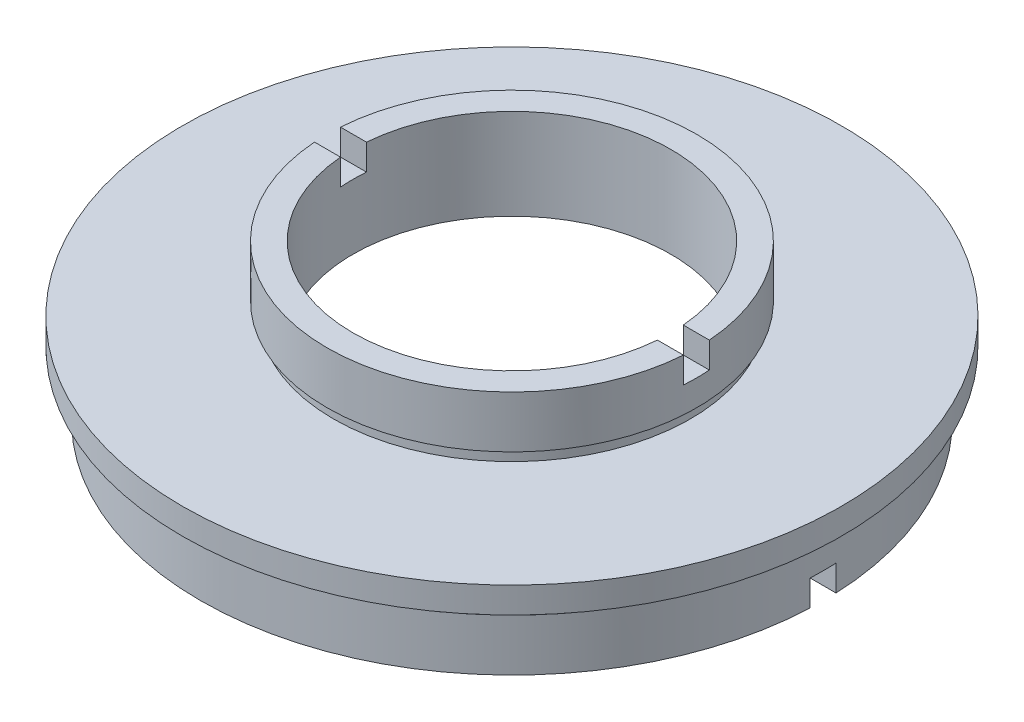
ISO-10303-21;
HEADER;
FILE_DESCRIPTION(('STEP AP214'),'2;1');
FILE_NAME('part.step','',(''),(''),'','','');
FILE_SCHEMA(('AUTOMOTIVE_DESIGN { 1 0 10303 214 1 1 1 1 }'));
ENDSEC;
DATA;
#1=APPLICATION_CONTEXT('core data for automotive mechanical design processes');
#2=APPLICATION_PROTOCOL_DEFINITION('international standard','automotive_design',2000,#1);
#3=PRODUCT_CONTEXT('',#1,'mechanical');
#4=PRODUCT('Part','Part','',(#3));
#5=PRODUCT_RELATED_PRODUCT_CATEGORY('part','',(#4));
#6=PRODUCT_DEFINITION_FORMATION('','',#4);
#7=PRODUCT_DEFINITION_CONTEXT('part definition',#1,'design');
#8=PRODUCT_DEFINITION('design','',#6,#7);
#9=PRODUCT_DEFINITION_SHAPE('','',#8);
#10=(LENGTH_UNIT() NAMED_UNIT(*) SI_UNIT(.MILLI.,.METRE.));
#11=(NAMED_UNIT(*) PLANE_ANGLE_UNIT() SI_UNIT($,.RADIAN.));
#12=(NAMED_UNIT(*) SI_UNIT($,.STERADIAN.) SOLID_ANGLE_UNIT());
#13=UNCERTAINTY_MEASURE_WITH_UNIT(LENGTH_MEASURE(1.E-05),#10,'distance_accuracy_value','');
#14=(GEOMETRIC_REPRESENTATION_CONTEXT(3) GLOBAL_UNCERTAINTY_ASSIGNED_CONTEXT((#13)) GLOBAL_UNIT_ASSIGNED_CONTEXT((#10,
#11,#12)) REPRESENTATION_CONTEXT('',''));
#15=CARTESIAN_POINT('',(0.,0.,0.));
#16=DIRECTION('',(0.,0.,1.));
#17=DIRECTION('',(1.,0.,0.));
#18=AXIS2_PLACEMENT_3D('',#15,#16,#17);
#19=CARTESIAN_POINT('',(-24.,0.,0.));
#20=DIRECTION('',(0.,-1.,0.));
#21=DIRECTION('',(0.,0.,-1.));
#22=AXIS2_PLACEMENT_3D('',#19,#20,#21);
#23=PLANE('',#22);
#24=DIRECTION('',(-1.,0.,0.));
#25=VECTOR('',#24,1.);
#26=CARTESIAN_POINT('',(-24.,0.,1.));
#27=LINE('',#26,#25);
#28=CARTESIAN_POINT('',(23.9791576165636,0.,1.));
#29=VERTEX_POINT('',#28);
#30=CARTESIAN_POINT('',(20.4755952294433,0.,1.));
#31=VERTEX_POINT('',#30);
#32=EDGE_CURVE('E184',#29,#31,#27,.T.);
#33=ORIENTED_EDGE('',*,*,#32,.F.);
#34=CARTESIAN_POINT('',(0.,0.,0.));
#35=DIRECTION('',(0.,1.,0.));
#36=DIRECTION('',(0.,0.,1.));
#37=AXIS2_PLACEMENT_3D('',#34,#35,#36);
#38=CIRCLE('',#37,24.);
#39=CARTESIAN_POINT('',(-23.9791576165636,0.,1.));
#40=VERTEX_POINT('',#39);
#41=EDGE_CURVE('E239',#40,#29,#38,.T.);
#42=ORIENTED_EDGE('',*,*,#41,.F.);
#43=CARTESIAN_POINT('',(-20.4755952294433,0.,1.));
#44=VERTEX_POINT('',#43);
#45=EDGE_CURVE('E162',#44,#40,#27,.T.);
#46=ORIENTED_EDGE('',*,*,#45,.F.);
#47=CARTESIAN_POINT('',(0.,0.,0.));
#48=DIRECTION('',(0.,1.,0.));
#49=DIRECTION('',(0.,0.,1.));
#50=AXIS2_PLACEMENT_3D('',#47,#48,#49);
#51=CIRCLE('',#50,20.5);
#52=EDGE_CURVE('E235',#44,#31,#51,.T.);
#53=ORIENTED_EDGE('',*,*,#52,.T.);
#54=EDGE_LOOP('',(#33,#42,#46,#53));
#55=FACE_BOUND('',#54,.T.);
#56=ADVANCED_FACE('F39',(#55),#23,.T.);
#57=CARTESIAN_POINT('',(-12.25,12.,0.));
#58=DIRECTION('',(0.,1.,0.));
#59=DIRECTION('',(0.,0.,1.));
#60=AXIS2_PLACEMENT_3D('',#57,#58,#59);
#61=PLANE('',#60);
#62=DIRECTION('',(1.,0.,0.));
#63=VECTOR('',#62,1.);
#64=CARTESIAN_POINT('',(-12.25,12.,1.));
#65=LINE('',#64,#63);
#66=CARTESIAN_POINT('',(-14.2148689758295,12.,1.));
#67=VERTEX_POINT('',#66);
#68=CARTESIAN_POINT('',(-12.2091154470748,12.,1.));
#69=VERTEX_POINT('',#68);
#70=EDGE_CURVE('E271',#67,#69,#65,.T.);
#71=ORIENTED_EDGE('',*,*,#70,.F.);
#72=CARTESIAN_POINT('',(0.,12.,0.));
#73=DIRECTION('',(0.,1.,0.));
#74=DIRECTION('',(0.,0.,1.));
#75=AXIS2_PLACEMENT_3D('',#72,#73,#74);
#76=CIRCLE('',#75,14.25);
#77=CARTESIAN_POINT('',(14.2148689758295,12.,1.));
#78=VERTEX_POINT('',#77);
#79=EDGE_CURVE('E215',#67,#78,#76,.T.);
#80=ORIENTED_EDGE('',*,*,#79,.T.);
#81=CARTESIAN_POINT('',(12.2091154470748,12.,1.));
#82=VERTEX_POINT('',#81);
#83=EDGE_CURVE('E269',#82,#78,#65,.T.);
#84=ORIENTED_EDGE('',*,*,#83,.F.);
#85=CARTESIAN_POINT('',(0.,12.,0.));
#86=DIRECTION('',(0.,1.,0.));
#87=DIRECTION('',(0.,0.,1.));
#88=AXIS2_PLACEMENT_3D('',#85,#86,#87);
#89=CIRCLE('',#88,12.25);
#90=EDGE_CURVE('E219',#69,#82,#89,.T.);
#91=ORIENTED_EDGE('',*,*,#90,.F.);
#92=EDGE_LOOP('',(#71,#80,#84,#91));
#93=FACE_BOUND('',#92,.T.);
#94=ADVANCED_FACE('F320',(#93),#61,.T.);
#95=CARTESIAN_POINT('',(0.,22.6774994510759,0.));
#96=DIRECTION('',(0.,1.,0.));
#97=DIRECTION('',(0.,0.,1.));
#98=AXIS2_PLACEMENT_3D('',#95,#96,#97);
#99=CYLINDRICAL_SURFACE('',#98,14.25);
#100=DIRECTION('',(0.,1.,0.));
#101=VECTOR('',#100,1.);
#102=CARTESIAN_POINT('',(-14.2148689758295,22.6774994510759,1.));
#103=LINE('',#102,#101);
#104=CARTESIAN_POINT('',(-14.2148689758295,10.,1.));
#105=VERTEX_POINT('',#104);
#106=EDGE_CURVE('E210',#105,#67,#103,.T.);
#107=ORIENTED_EDGE('',*,*,#106,.F.);
#108=CARTESIAN_POINT('',(0.,10.,0.));
#109=DIRECTION('',(0.,-1.,0.));
#110=DIRECTION('',(0.,0.,-1.));
#111=AXIS2_PLACEMENT_3D('',#108,#109,#110);
#112=CIRCLE('',#111,14.25);
#113=CARTESIAN_POINT('',(-14.2148689758295,10.,-0.999999999999997));
#114=VERTEX_POINT('',#113);
#115=EDGE_CURVE('E214',#114,#105,#112,.F.);
#116=ORIENTED_EDGE('',*,*,#115,.F.);
#117=DIRECTION('',(0.,1.,0.));
#118=VECTOR('',#117,1.);
#119=CARTESIAN_POINT('',(-14.2148689758295,22.6774994510759,-1.));
#120=LINE('',#119,#118);
#121=CARTESIAN_POINT('',(-14.2148689758295,12.,-0.999999999999998));
#122=VERTEX_POINT('',#121);
#123=EDGE_CURVE('E198',#122,#114,#120,.F.);
#124=ORIENTED_EDGE('',*,*,#123,.F.);
#125=CARTESIAN_POINT('',(14.2148689758295,12.,-0.999999999999998));
#126=VERTEX_POINT('',#125);
#127=EDGE_CURVE('E218',#126,#122,#76,.T.);
#128=ORIENTED_EDGE('',*,*,#127,.F.);
#129=DIRECTION('',(0.,1.,0.));
#130=VECTOR('',#129,1.);
#131=CARTESIAN_POINT('',(14.2148689758295,22.6774994510759,-1.));
#132=LINE('',#131,#130);
#133=CARTESIAN_POINT('',(14.2148689758295,10.,-0.999999999999997));
#134=VERTEX_POINT('',#133);
#135=EDGE_CURVE('E202',#134,#126,#132,.T.);
#136=ORIENTED_EDGE('',*,*,#135,.F.);
#137=CARTESIAN_POINT('',(14.2148689758295,10.,1.));
#138=VERTEX_POINT('',#137);
#139=EDGE_CURVE('E212',#138,#134,#112,.F.);
#140=ORIENTED_EDGE('',*,*,#139,.F.);
#141=DIRECTION('',(0.,1.,0.));
#142=VECTOR('',#141,1.);
#143=CARTESIAN_POINT('',(14.2148689758295,22.6774994510759,1.));
#144=LINE('',#143,#142);
#145=EDGE_CURVE('E206',#78,#138,#144,.F.);
#146=ORIENTED_EDGE('',*,*,#145,.F.);
#147=ORIENTED_EDGE('',*,*,#79,.F.);
#148=EDGE_LOOP('',(#107,#116,#124,#128,#136,#140,#146,#147));
#149=FACE_BOUND('',#148,.T.);
#150=CARTESIAN_POINT('',(0.,8.,0.));
#151=DIRECTION('',(0.,1.,0.));
#152=DIRECTION('',(0.,0.,1.));
#153=AXIS2_PLACEMENT_3D('',#150,#151,#152);
#154=CIRCLE('',#153,14.25);
#155=CARTESIAN_POINT('',(0.,8.,14.25));
#156=VERTEX_POINT('',#155);
#157=EDGE_CURVE('E263',#156,#156,#154,.T.);
#158=ORIENTED_EDGE('',*,*,#157,.T.);
#159=EDGE_LOOP('',(#158));
#160=FACE_BOUND('',#159,.T.);
#161=ADVANCED_FACE('F41',(#149,#160),#99,.T.);
#162=CARTESIAN_POINT('',(-14.25,8.,0.));
#163=DIRECTION('',(0.,-1.,0.));
#164=DIRECTION('',(0.,0.,-1.));
#165=AXIS2_PLACEMENT_3D('',#162,#163,#164);
#166=PLANE('',#165);
#167=CARTESIAN_POINT('',(0.,8.,0.));
#168=DIRECTION('',(0.,1.,0.));
#169=DIRECTION('',(0.,0.,1.));
#170=AXIS2_PLACEMENT_3D('',#167,#168,#169);
#171=CIRCLE('',#170,13.75);
#172=CARTESIAN_POINT('',(0.,8.,13.75));
#173=VERTEX_POINT('',#172);
#174=EDGE_CURVE('E260',#173,#173,#171,.T.);
#175=ORIENTED_EDGE('',*,*,#174,.T.);
#176=EDGE_LOOP('',(#175));
#177=FACE_BOUND('',#176,.T.);
#178=ORIENTED_EDGE('',*,*,#157,.F.);
#179=EDGE_LOOP('',(#178));
#180=FACE_BOUND('',#179,.T.);
#181=ADVANCED_FACE('F330',(#177,#180),#166,.T.);
#182=CARTESIAN_POINT('',(0.,22.6774994510759,0.));
#183=DIRECTION('',(0.,1.,0.));
#184=DIRECTION('',(0.,0.,1.));
#185=AXIS2_PLACEMENT_3D('',#182,#183,#184);
#186=CYLINDRICAL_SURFACE('',#185,13.75);
#187=CARTESIAN_POINT('',(0.,7.,0.));
#188=DIRECTION('',(0.,1.,0.));
#189=DIRECTION('',(0.,0.,1.));
#190=AXIS2_PLACEMENT_3D('',#187,#188,#189);
#191=CIRCLE('',#190,13.75);
#192=CARTESIAN_POINT('',(0.,7.,13.75));
#193=VERTEX_POINT('',#192);
#194=EDGE_CURVE('E257',#193,#193,#191,.T.);
#195=ORIENTED_EDGE('',*,*,#194,.T.);
#196=EDGE_LOOP('',(#195));
#197=FACE_BOUND('',#196,.T.);
#198=ORIENTED_EDGE('',*,*,#174,.F.);
#199=EDGE_LOOP('',(#198));
#200=FACE_BOUND('',#199,.T.);
#201=ADVANCED_FACE('F569',(#197,#200),#186,.T.);
#202=CARTESIAN_POINT('',(-13.75,7.,0.));
#203=DIRECTION('',(0.,1.,0.));
#204=DIRECTION('',(0.,0.,1.));
#205=AXIS2_PLACEMENT_3D('',#202,#203,#204);
#206=PLANE('',#205);
#207=CARTESIAN_POINT('',(0.,7.,0.));
#208=DIRECTION('',(0.,1.,0.));
#209=DIRECTION('',(0.,0.,1.));
#210=AXIS2_PLACEMENT_3D('',#207,#208,#209);
#211=CIRCLE('',#210,25.4);
#212=CARTESIAN_POINT('',(0.,7.,25.4));
#213=VERTEX_POINT('',#212);
#214=EDGE_CURVE('E254',#213,#213,#211,.T.);
#215=ORIENTED_EDGE('',*,*,#214,.T.);
#216=EDGE_LOOP('',(#215));
#217=FACE_BOUND('',#216,.T.);
#218=ORIENTED_EDGE('',*,*,#194,.F.);
#219=EDGE_LOOP('',(#218));
#220=FACE_BOUND('',#219,.T.);
#221=ADVANCED_FACE('F560',(#217,#220),#206,.T.);
#222=CARTESIAN_POINT('',(0.,22.6774994510759,0.));
#223=DIRECTION('',(0.,1.,0.));
#224=DIRECTION('',(0.,0.,1.));
#225=AXIS2_PLACEMENT_3D('',#222,#223,#224);
#226=CYLINDRICAL_SURFACE('',#225,25.4);
#227=CARTESIAN_POINT('',(0.,5.,0.));
#228=DIRECTION('',(0.,1.,0.));
#229=DIRECTION('',(0.,0.,1.));
#230=AXIS2_PLACEMENT_3D('',#227,#228,#229);
#231=CIRCLE('',#230,25.4);
#232=CARTESIAN_POINT('',(0.,5.,25.4));
#233=VERTEX_POINT('',#232);
#234=EDGE_CURVE('E251',#233,#233,#231,.T.);
#235=ORIENTED_EDGE('',*,*,#234,.T.);
#236=EDGE_LOOP('',(#235));
#237=FACE_BOUND('',#236,.T.);
#238=ORIENTED_EDGE('',*,*,#214,.F.);
#239=EDGE_LOOP('',(#238));
#240=FACE_BOUND('',#239,.T.);
#241=ADVANCED_FACE('F551',(#237,#240),#226,.T.);
#242=CARTESIAN_POINT('',(-25.4,5.,0.));
#243=DIRECTION('',(0.,-1.,0.));
#244=DIRECTION('',(0.,0.,-1.));
#245=AXIS2_PLACEMENT_3D('',#242,#243,#244);
#246=PLANE('',#245);
#247=CARTESIAN_POINT('',(0.,5.,0.));
#248=DIRECTION('',(0.,1.,0.));
#249=DIRECTION('',(0.,0.,1.));
#250=AXIS2_PLACEMENT_3D('',#247,#248,#249);
#251=CIRCLE('',#250,23.5);
#252=CARTESIAN_POINT('',(0.,5.,23.5));
#253=VERTEX_POINT('',#252);
#254=EDGE_CURVE('E248',#253,#253,#251,.T.);
#255=ORIENTED_EDGE('',*,*,#254,.T.);
#256=EDGE_LOOP('',(#255));
#257=FACE_BOUND('',#256,.T.);
#258=ORIENTED_EDGE('',*,*,#234,.F.);
#259=EDGE_LOOP('',(#258));
#260=FACE_BOUND('',#259,.T.);
#261=ADVANCED_FACE('F542',(#257,#260),#246,.T.);
#262=CARTESIAN_POINT('',(0.,22.6774994510759,0.));
#263=DIRECTION('',(0.,1.,0.));
#264=DIRECTION('',(0.,0.,1.));
#265=AXIS2_PLACEMENT_3D('',#262,#263,#264);
#266=CYLINDRICAL_SURFACE('',#265,23.5);
#267=CARTESIAN_POINT('',(0.,4.,0.));
#268=DIRECTION('',(0.,1.,0.));
#269=DIRECTION('',(0.,0.,1.));
#270=AXIS2_PLACEMENT_3D('',#267,#268,#269);
#271=CIRCLE('',#270,23.5);
#272=CARTESIAN_POINT('',(0.,4.,23.5));
#273=VERTEX_POINT('',#272);
#274=EDGE_CURVE('E245',#273,#273,#271,.T.);
#275=ORIENTED_EDGE('',*,*,#274,.T.);
#276=EDGE_LOOP('',(#275));
#277=FACE_BOUND('',#276,.T.);
#278=ORIENTED_EDGE('',*,*,#254,.F.);
#279=EDGE_LOOP('',(#278));
#280=FACE_BOUND('',#279,.T.);
#281=ADVANCED_FACE('F533',(#277,#280),#266,.T.);
#282=CARTESIAN_POINT('',(-23.5,4.,0.));
#283=DIRECTION('',(0.,1.,0.));
#284=DIRECTION('',(0.,0.,1.));
#285=AXIS2_PLACEMENT_3D('',#282,#283,#284);
#286=PLANE('',#285);
#287=CARTESIAN_POINT('',(0.,4.,0.));
#288=DIRECTION('',(0.,1.,0.));
#289=DIRECTION('',(0.,0.,1.));
#290=AXIS2_PLACEMENT_3D('',#287,#288,#289);
#291=CIRCLE('',#290,24.);
#292=CARTESIAN_POINT('',(0.,4.,24.));
#293=VERTEX_POINT('',#292);
#294=EDGE_CURVE('E242',#293,#293,#291,.T.);
#295=ORIENTED_EDGE('',*,*,#294,.T.);
#296=EDGE_LOOP('',(#295));
#297=FACE_BOUND('',#296,.T.);
#298=ORIENTED_EDGE('',*,*,#274,.F.);
#299=EDGE_LOOP('',(#298));
#300=FACE_BOUND('',#299,.T.);
#301=ADVANCED_FACE('F317',(#297,#300),#286,.T.);
#302=CARTESIAN_POINT('',(0.,22.6774994510759,0.));
#303=DIRECTION('',(0.,1.,0.));
#304=DIRECTION('',(0.,0.,1.));
#305=AXIS2_PLACEMENT_3D('',#302,#303,#304);
#306=CYLINDRICAL_SURFACE('',#305,24.);
#307=DIRECTION('',(0.,1.,0.));
#308=VECTOR('',#307,1.);
#309=CARTESIAN_POINT('',(-23.9791576165636,22.6774994510759,1.));
#310=LINE('',#309,#308);
#311=CARTESIAN_POINT('',(-23.9791576165636,2.,1.));
#312=VERTEX_POINT('',#311);
#313=EDGE_CURVE('E183',#40,#312,#310,.T.);
#314=ORIENTED_EDGE('',*,*,#313,.F.);
#315=ORIENTED_EDGE('',*,*,#41,.T.);
#316=DIRECTION('',(0.,1.,0.));
#317=VECTOR('',#316,1.);
#318=CARTESIAN_POINT('',(23.9791576165636,22.6774994510759,1.));
#319=LINE('',#318,#317);
#320=CARTESIAN_POINT('',(23.9791576165636,2.,1.));
#321=VERTEX_POINT('',#320);
#322=EDGE_CURVE('E186',#321,#29,#319,.F.);
#323=ORIENTED_EDGE('',*,*,#322,.F.);
#324=CARTESIAN_POINT('',(0.,2.,0.));
#325=DIRECTION('',(0.,1.,0.));
#326=DIRECTION('',(0.,0.,1.));
#327=AXIS2_PLACEMENT_3D('',#324,#325,#326);
#328=CIRCLE('',#327,24.);
#329=CARTESIAN_POINT('',(23.9791576165636,2.,-1.));
#330=VERTEX_POINT('',#329);
#331=EDGE_CURVE('E163',#330,#321,#328,.F.);
#332=ORIENTED_EDGE('',*,*,#331,.F.);
#333=DIRECTION('',(0.,1.,0.));
#334=VECTOR('',#333,1.);
#335=CARTESIAN_POINT('',(23.9791576165636,22.6774994510759,-0.999999999999994));
#336=LINE('',#335,#334);
#337=CARTESIAN_POINT('',(23.9791576165636,0.,-1.));
#338=VERTEX_POINT('',#337);
#339=EDGE_CURVE('E177',#338,#330,#336,.T.);
#340=ORIENTED_EDGE('',*,*,#339,.F.);
#341=CARTESIAN_POINT('',(-23.9791576165636,0.,-1.));
#342=VERTEX_POINT('',#341);
#343=EDGE_CURVE('E175',#338,#342,#38,.T.);
#344=ORIENTED_EDGE('',*,*,#343,.T.);
#345=DIRECTION('',(0.,1.,0.));
#346=VECTOR('',#345,1.);
#347=CARTESIAN_POINT('',(-23.9791576165636,22.6774994510759,-0.999999999999994));
#348=LINE('',#347,#346);
#349=CARTESIAN_POINT('',(-23.9791576165636,2.,-1.));
#350=VERTEX_POINT('',#349);
#351=EDGE_CURVE('E166',#350,#342,#348,.F.);
#352=ORIENTED_EDGE('',*,*,#351,.F.);
#353=EDGE_CURVE('E152',#312,#350,#328,.F.);
#354=ORIENTED_EDGE('',*,*,#353,.F.);
#355=EDGE_LOOP('',(#314,#315,#323,#332,#340,#344,#352,#354));
#356=FACE_BOUND('',#355,.T.);
#357=ORIENTED_EDGE('',*,*,#294,.F.);
#358=EDGE_LOOP('',(#357));
#359=FACE_BOUND('',#358,.T.);
#360=ADVANCED_FACE('F171',(#356,#359),#306,.T.);
#361=DIRECTION('',(1.,0.,0.));
#362=VECTOR('',#361,1.);
#363=CARTESIAN_POINT('',(-24.,0.,-1.));
#364=LINE('',#363,#362);
#365=CARTESIAN_POINT('',(-20.4755952294433,0.,-0.999999999999995));
#366=VERTEX_POINT('',#365);
#367=EDGE_CURVE('E62',#342,#366,#364,.T.);
#368=ORIENTED_EDGE('',*,*,#367,.F.);
#369=ORIENTED_EDGE('',*,*,#343,.F.);
#370=CARTESIAN_POINT('',(20.4755952294433,0.,-0.999999999999994));
#371=VERTEX_POINT('',#370);
#372=EDGE_CURVE('E179',#371,#338,#364,.T.);
#373=ORIENTED_EDGE('',*,*,#372,.F.);
#374=EDGE_CURVE('E238',#371,#366,#51,.T.);
#375=ORIENTED_EDGE('',*,*,#374,.T.);
#376=EDGE_LOOP('',(#368,#369,#373,#375));
#377=FACE_BOUND('',#376,.T.);
#378=ADVANCED_FACE('F308',(#377),#23,.T.);
#379=CARTESIAN_POINT('',(0.,22.6774994510759,0.));
#380=DIRECTION('',(0.,1.,0.));
#381=DIRECTION('',(0.,0.,1.));
#382=AXIS2_PLACEMENT_3D('',#379,#380,#381);
#383=CYLINDRICAL_SURFACE('',#382,20.5);
#384=DIRECTION('',(0.,1.,0.));
#385=VECTOR('',#384,1.);
#386=CARTESIAN_POINT('',(-20.4755952294433,22.6774994510759,1.));
#387=LINE('',#386,#385);
#388=CARTESIAN_POINT('',(-20.4755952294433,2.,1.));
#389=VERTEX_POINT('',#388);
#390=EDGE_CURVE('E12',#389,#44,#387,.F.);
#391=ORIENTED_EDGE('',*,*,#390,.F.);
#392=CARTESIAN_POINT('',(0.,2.,0.));
#393=DIRECTION('',(0.,1.,0.));
#394=DIRECTION('',(0.,0.,1.));
#395=AXIS2_PLACEMENT_3D('',#392,#393,#394);
#396=CIRCLE('',#395,20.5);
#397=CARTESIAN_POINT('',(-20.4755952294433,2.,-1.));
#398=VERTEX_POINT('',#397);
#399=EDGE_CURVE('E47',#398,#389,#396,.T.);
#400=ORIENTED_EDGE('',*,*,#399,.F.);
#401=DIRECTION('',(0.,1.,0.));
#402=VECTOR('',#401,1.);
#403=CARTESIAN_POINT('',(-20.4755952294433,22.6774994510759,-0.999999999999994));
#404=LINE('',#403,#402);
#405=EDGE_CURVE('E167',#366,#398,#404,.T.);
#406=ORIENTED_EDGE('',*,*,#405,.F.);
#407=ORIENTED_EDGE('',*,*,#374,.F.);
#408=DIRECTION('',(0.,1.,0.));
#409=VECTOR('',#408,1.);
#410=CARTESIAN_POINT('',(20.4755952294433,22.6774994510759,-0.999999999999994));
#411=LINE('',#410,#409);
#412=CARTESIAN_POINT('',(20.4755952294433,2.,-0.999999999999994));
#413=VERTEX_POINT('',#412);
#414=EDGE_CURVE('E275',#413,#371,#411,.F.);
#415=ORIENTED_EDGE('',*,*,#414,.F.);
#416=CARTESIAN_POINT('',(20.4755952294433,2.,1.));
#417=VERTEX_POINT('',#416);
#418=EDGE_CURVE('E277',#417,#413,#396,.T.);
#419=ORIENTED_EDGE('',*,*,#418,.F.);
#420=DIRECTION('',(0.,1.,0.));
#421=VECTOR('',#420,1.);
#422=CARTESIAN_POINT('',(20.4755952294433,22.6774994510759,1.));
#423=LINE('',#422,#421);
#424=EDGE_CURVE('E279',#31,#417,#423,.T.);
#425=ORIENTED_EDGE('',*,*,#424,.F.);
#426=ORIENTED_EDGE('',*,*,#52,.F.);
#427=EDGE_LOOP('',(#391,#400,#406,#407,#415,#419,#425,#426));
#428=FACE_BOUND('',#427,.T.);
#429=CARTESIAN_POINT('',(0.,4.,0.));
#430=DIRECTION('',(0.,1.,0.));
#431=DIRECTION('',(0.,0.,1.));
#432=AXIS2_PLACEMENT_3D('',#429,#430,#431);
#433=CIRCLE('',#432,20.5);
#434=CARTESIAN_POINT('',(0.,4.,20.5));
#435=VERTEX_POINT('',#434);
#436=EDGE_CURVE('E232',#435,#435,#433,.T.);
#437=ORIENTED_EDGE('',*,*,#436,.T.);
#438=EDGE_LOOP('',(#437));
#439=FACE_BOUND('',#438,.T.);
#440=ADVANCED_FACE('F287',(#428,#439),#383,.F.);
#441=CARTESIAN_POINT('',(-21.1,4.,0.));
#442=DIRECTION('',(0.,1.,0.));
#443=DIRECTION('',(0.,0.,1.));
#444=AXIS2_PLACEMENT_3D('',#441,#442,#443);
#445=PLANE('',#444);
#446=CARTESIAN_POINT('',(0.,4.,0.));
#447=DIRECTION('',(0.,1.,0.));
#448=DIRECTION('',(0.,0.,1.));
#449=AXIS2_PLACEMENT_3D('',#446,#447,#448);
#450=CIRCLE('',#449,21.1);
#451=CARTESIAN_POINT('',(0.,4.,21.1));
#452=VERTEX_POINT('',#451);
#453=EDGE_CURVE('E229',#452,#452,#450,.T.);
#454=ORIENTED_EDGE('',*,*,#453,.T.);
#455=EDGE_LOOP('',(#454));
#456=FACE_BOUND('',#455,.T.);
#457=ORIENTED_EDGE('',*,*,#436,.F.);
#458=EDGE_LOOP('',(#457));
#459=FACE_BOUND('',#458,.T.);
#460=ADVANCED_FACE('F315',(#456,#459),#445,.T.);
#461=CARTESIAN_POINT('',(0.,22.6774994510759,0.));
#462=DIRECTION('',(0.,1.,0.));
#463=DIRECTION('',(0.,0.,1.));
#464=AXIS2_PLACEMENT_3D('',#461,#462,#463);
#465=CYLINDRICAL_SURFACE('',#464,21.1);
#466=CARTESIAN_POINT('',(0.,5.,0.));
#467=DIRECTION('',(0.,1.,0.));
#468=DIRECTION('',(0.,0.,1.));
#469=AXIS2_PLACEMENT_3D('',#466,#467,#468);
#470=CIRCLE('',#469,21.1);
#471=CARTESIAN_POINT('',(0.,5.,21.1));
#472=VERTEX_POINT('',#471);
#473=EDGE_CURVE('E226',#472,#472,#470,.T.);
#474=ORIENTED_EDGE('',*,*,#473,.T.);
#475=EDGE_LOOP('',(#474));
#476=FACE_BOUND('',#475,.T.);
#477=ORIENTED_EDGE('',*,*,#453,.F.);
#478=EDGE_LOOP('',(#477));
#479=FACE_BOUND('',#478,.T.);
#480=ADVANCED_FACE('F493',(#476,#479),#465,.F.);
#481=CARTESIAN_POINT('',(-12.25,5.,0.));
#482=DIRECTION('',(0.,-1.,0.));
#483=DIRECTION('',(0.,0.,-1.));
#484=AXIS2_PLACEMENT_3D('',#481,#482,#483);
#485=PLANE('',#484);
#486=CARTESIAN_POINT('',(0.,5.,0.));
#487=DIRECTION('',(0.,1.,0.));
#488=DIRECTION('',(0.,0.,1.));
#489=AXIS2_PLACEMENT_3D('',#486,#487,#488);
#490=CIRCLE('',#489,12.25);
#491=CARTESIAN_POINT('',(0.,5.,12.25));
#492=VERTEX_POINT('',#491);
#493=EDGE_CURVE('E223',#492,#492,#490,.T.);
#494=ORIENTED_EDGE('',*,*,#493,.T.);
#495=EDGE_LOOP('',(#494));
#496=FACE_BOUND('',#495,.T.);
#497=ORIENTED_EDGE('',*,*,#473,.F.);
#498=EDGE_LOOP('',(#497));
#499=FACE_BOUND('',#498,.T.);
#500=ADVANCED_FACE('F346',(#496,#499),#485,.T.);
#501=CARTESIAN_POINT('',(0.,22.6774994510759,0.));
#502=DIRECTION('',(0.,1.,0.));
#503=DIRECTION('',(0.,0.,1.));
#504=AXIS2_PLACEMENT_3D('',#501,#502,#503);
#505=CYLINDRICAL_SURFACE('',#504,12.25);
#506=DIRECTION('',(0.,1.,0.));
#507=VECTOR('',#506,1.);
#508=CARTESIAN_POINT('',(12.2091154470748,22.6774994510759,1.));
#509=LINE('',#508,#507);
#510=CARTESIAN_POINT('',(12.2091154470748,10.,1.));
#511=VERTEX_POINT('',#510);
#512=EDGE_CURVE('E204',#511,#82,#509,.T.);
#513=ORIENTED_EDGE('',*,*,#512,.F.);
#514=CARTESIAN_POINT('',(0.,10.,0.));
#515=DIRECTION('',(0.,-1.,0.));
#516=DIRECTION('',(0.,0.,-1.));
#517=AXIS2_PLACEMENT_3D('',#514,#515,#516);
#518=CIRCLE('',#517,12.25);
#519=CARTESIAN_POINT('',(12.2091154470748,10.,-0.999999999999997));
#520=VERTEX_POINT('',#519);
#521=EDGE_CURVE('E274',#520,#511,#518,.T.);
#522=ORIENTED_EDGE('',*,*,#521,.F.);
#523=DIRECTION('',(0.,1.,0.));
#524=VECTOR('',#523,1.);
#525=CARTESIAN_POINT('',(12.2091154470748,22.6774994510759,-1.));
#526=LINE('',#525,#524);
#527=CARTESIAN_POINT('',(12.2091154470748,12.,-0.999999999999998));
#528=VERTEX_POINT('',#527);
#529=EDGE_CURVE('E200',#528,#520,#526,.F.);
#530=ORIENTED_EDGE('',*,*,#529,.F.);
#531=CARTESIAN_POINT('',(-12.2091154470748,12.,-0.999999999999998));
#532=VERTEX_POINT('',#531);
#533=EDGE_CURVE('E222',#528,#532,#89,.T.);
#534=ORIENTED_EDGE('',*,*,#533,.T.);
#535=DIRECTION('',(0.,1.,0.));
#536=VECTOR('',#535,1.);
#537=CARTESIAN_POINT('',(-12.2091154470748,22.6774994510759,-1.));
#538=LINE('',#537,#536);
#539=CARTESIAN_POINT('',(-12.2091154470748,10.,-0.999999999999997));
#540=VERTEX_POINT('',#539);
#541=EDGE_CURVE('E196',#540,#532,#538,.T.);
#542=ORIENTED_EDGE('',*,*,#541,.F.);
#543=CARTESIAN_POINT('',(-12.2091154470748,10.,1.));
#544=VERTEX_POINT('',#543);
#545=EDGE_CURVE('E272',#544,#540,#518,.T.);
#546=ORIENTED_EDGE('',*,*,#545,.F.);
#547=DIRECTION('',(0.,1.,0.));
#548=VECTOR('',#547,1.);
#549=CARTESIAN_POINT('',(-12.2091154470748,22.6774994510759,1.));
#550=LINE('',#549,#548);
#551=EDGE_CURVE('E208',#69,#544,#550,.F.);
#552=ORIENTED_EDGE('',*,*,#551,.F.);
#553=ORIENTED_EDGE('',*,*,#90,.T.);
#554=EDGE_LOOP('',(#513,#522,#530,#534,#542,#546,#552,#553));
#555=FACE_BOUND('',#554,.T.);
#556=ORIENTED_EDGE('',*,*,#493,.F.);
#557=EDGE_LOOP('',(#556));
#558=FACE_BOUND('',#557,.T.);
#559=ADVANCED_FACE('F337',(#555,#558),#505,.F.);
#560=DIRECTION('',(-1.,0.,0.));
#561=VECTOR('',#560,1.);
#562=CARTESIAN_POINT('',(-12.25,12.,-0.999999999999998));
#563=LINE('',#562,#561);
#564=EDGE_CURVE('E268',#126,#528,#563,.T.);
#565=ORIENTED_EDGE('',*,*,#564,.F.);
#566=ORIENTED_EDGE('',*,*,#127,.T.);
#567=EDGE_CURVE('E266',#532,#122,#563,.T.);
#568=ORIENTED_EDGE('',*,*,#567,.F.);
#569=ORIENTED_EDGE('',*,*,#533,.F.);
#570=EDGE_LOOP('',(#565,#566,#568,#569));
#571=FACE_BOUND('',#570,.T.);
#572=ADVANCED_FACE('F326',(#571),#61,.T.);
#573=CARTESIAN_POINT('',(-39.5,13.5939878717808,1.));
#574=DIRECTION('',(0.,0.,1.));
#575=DIRECTION('',(0.,-1.,0.));
#576=AXIS2_PLACEMENT_3D('',#573,#574,#575);
#577=PLANE('',#576);
#578=ORIENTED_EDGE('',*,*,#106,.T.);
#579=ORIENTED_EDGE('',*,*,#70,.T.);
#580=ORIENTED_EDGE('',*,*,#551,.T.);
#581=DIRECTION('',(1.,0.,0.));
#582=VECTOR('',#581,1.);
#583=CARTESIAN_POINT('',(-39.5,10.,1.));
#584=LINE('',#583,#582);
#585=EDGE_CURVE('E193',#105,#544,#584,.T.);
#586=ORIENTED_EDGE('',*,*,#585,.F.);
#587=EDGE_LOOP('',(#578,#579,#580,#586));
#588=FACE_BOUND('',#587,.T.);
#589=ADVANCED_FACE('F336',(#588),#577,.F.);
#590=CARTESIAN_POINT('',(-39.5,13.5939878717808,-0.999999999999998));
#591=DIRECTION('',(0.,0.,-1.));
#592=DIRECTION('',(0.,1.,0.));
#593=AXIS2_PLACEMENT_3D('',#590,#591,#592);
#594=PLANE('',#593);
#595=ORIENTED_EDGE('',*,*,#123,.T.);
#596=DIRECTION('',(1.,0.,0.));
#597=VECTOR('',#596,1.);
#598=CARTESIAN_POINT('',(-39.5,10.,-0.999999999999997));
#599=LINE('',#598,#597);
#600=EDGE_CURVE('E192',#114,#540,#599,.T.);
#601=ORIENTED_EDGE('',*,*,#600,.T.);
#602=ORIENTED_EDGE('',*,*,#541,.T.);
#603=ORIENTED_EDGE('',*,*,#567,.T.);
#604=EDGE_LOOP('',(#595,#601,#602,#603));
#605=FACE_BOUND('',#604,.T.);
#606=ADVANCED_FACE('F343',(#605),#594,.F.);
#607=CARTESIAN_POINT('',(-39.5,10.,1.));
#608=DIRECTION('',(0.,-1.,0.));
#609=DIRECTION('',(0.,0.,-1.));
#610=AXIS2_PLACEMENT_3D('',#607,#608,#609);
#611=PLANE('',#610);
#612=ORIENTED_EDGE('',*,*,#115,.T.);
#613=ORIENTED_EDGE('',*,*,#585,.T.);
#614=ORIENTED_EDGE('',*,*,#545,.T.);
#615=ORIENTED_EDGE('',*,*,#600,.F.);
#616=EDGE_LOOP('',(#612,#613,#614,#615));
#617=FACE_BOUND('',#616,.T.);
#618=ADVANCED_FACE('F367',(#617),#611,.F.);
#619=ORIENTED_EDGE('',*,*,#139,.T.);
#620=EDGE_CURVE('E189',#520,#134,#599,.T.);
#621=ORIENTED_EDGE('',*,*,#620,.F.);
#622=ORIENTED_EDGE('',*,*,#521,.T.);
#623=EDGE_CURVE('E188',#511,#138,#584,.T.);
#624=ORIENTED_EDGE('',*,*,#623,.T.);
#625=EDGE_LOOP('',(#619,#621,#622,#624));
#626=FACE_BOUND('',#625,.T.);
#627=ADVANCED_FACE('F379',(#626),#611,.F.);
#628=ORIENTED_EDGE('',*,*,#135,.T.);
#629=ORIENTED_EDGE('',*,*,#564,.T.);
#630=ORIENTED_EDGE('',*,*,#529,.T.);
#631=ORIENTED_EDGE('',*,*,#620,.T.);
#632=EDGE_LOOP('',(#628,#629,#630,#631));
#633=FACE_BOUND('',#632,.T.);
#634=ADVANCED_FACE('F377',(#633),#594,.F.);
#635=ORIENTED_EDGE('',*,*,#145,.T.);
#636=ORIENTED_EDGE('',*,*,#623,.F.);
#637=ORIENTED_EDGE('',*,*,#512,.T.);
#638=ORIENTED_EDGE('',*,*,#83,.T.);
#639=EDGE_LOOP('',(#635,#636,#637,#638));
#640=FACE_BOUND('',#639,.T.);
#641=ADVANCED_FACE('F345',(#640),#577,.F.);
#642=CARTESIAN_POINT('',(-39.5,2.,-1.));
#643=DIRECTION('',(0.,0.,-1.));
#644=DIRECTION('',(0.,1.,0.));
#645=AXIS2_PLACEMENT_3D('',#642,#643,#644);
#646=PLANE('',#645);
#647=ORIENTED_EDGE('',*,*,#339,.T.);
#648=DIRECTION('',(1.,0.,0.));
#649=VECTOR('',#648,1.);
#650=CARTESIAN_POINT('',(-39.5,2.,-1.));
#651=LINE('',#650,#649);
#652=EDGE_CURVE('E54',#413,#330,#651,.T.);
#653=ORIENTED_EDGE('',*,*,#652,.F.);
#654=ORIENTED_EDGE('',*,*,#414,.T.);
#655=ORIENTED_EDGE('',*,*,#372,.T.);
#656=EDGE_LOOP('',(#647,#653,#654,#655));
#657=FACE_BOUND('',#656,.T.);
#658=ADVANCED_FACE('F302',(#657),#646,.F.);
#659=CARTESIAN_POINT('',(-39.5,2.,1.));
#660=DIRECTION('',(0.,1.,0.));
#661=DIRECTION('',(0.,0.,1.));
#662=AXIS2_PLACEMENT_3D('',#659,#660,#661);
#663=PLANE('',#662);
#664=ORIENTED_EDGE('',*,*,#331,.T.);
#665=DIRECTION('',(1.,0.,0.));
#666=VECTOR('',#665,1.);
#667=CARTESIAN_POINT('',(-39.5,2.,1.));
#668=LINE('',#667,#666);
#669=EDGE_CURVE('E168',#417,#321,#668,.T.);
#670=ORIENTED_EDGE('',*,*,#669,.F.);
#671=ORIENTED_EDGE('',*,*,#418,.T.);
#672=ORIENTED_EDGE('',*,*,#652,.T.);
#673=EDGE_LOOP('',(#664,#670,#671,#672));
#674=FACE_BOUND('',#673,.T.);
#675=ADVANCED_FACE('F303',(#674),#663,.F.);
#676=CARTESIAN_POINT('',(-39.5,2.,1.));
#677=DIRECTION('',(0.,0.,1.));
#678=DIRECTION('',(0.,-1.,0.));
#679=AXIS2_PLACEMENT_3D('',#676,#677,#678);
#680=PLANE('',#679);
#681=ORIENTED_EDGE('',*,*,#322,.T.);
#682=ORIENTED_EDGE('',*,*,#32,.T.);
#683=ORIENTED_EDGE('',*,*,#424,.T.);
#684=ORIENTED_EDGE('',*,*,#669,.T.);
#685=EDGE_LOOP('',(#681,#682,#683,#684));
#686=FACE_BOUND('',#685,.T.);
#687=ADVANCED_FACE('F298',(#686),#680,.F.);
#688=ORIENTED_EDGE('',*,*,#351,.T.);
#689=ORIENTED_EDGE('',*,*,#367,.T.);
#690=ORIENTED_EDGE('',*,*,#405,.T.);
#691=EDGE_CURVE('E155',#350,#398,#651,.T.);
#692=ORIENTED_EDGE('',*,*,#691,.F.);
#693=EDGE_LOOP('',(#688,#689,#690,#692));
#694=FACE_BOUND('',#693,.T.);
#695=ADVANCED_FACE('F165',(#694),#646,.F.);
#696=ORIENTED_EDGE('',*,*,#313,.T.);
#697=EDGE_CURVE('E158',#312,#389,#668,.T.);
#698=ORIENTED_EDGE('',*,*,#697,.T.);
#699=ORIENTED_EDGE('',*,*,#390,.T.);
#700=ORIENTED_EDGE('',*,*,#45,.T.);
#701=EDGE_LOOP('',(#696,#698,#699,#700));
#702=FACE_BOUND('',#701,.T.);
#703=ADVANCED_FACE('F283',(#702),#680,.F.);
#704=ORIENTED_EDGE('',*,*,#353,.T.);
#705=ORIENTED_EDGE('',*,*,#691,.T.);
#706=ORIENTED_EDGE('',*,*,#399,.T.);
#707=ORIENTED_EDGE('',*,*,#697,.F.);
#708=EDGE_LOOP('',(#704,#705,#706,#707));
#709=FACE_BOUND('',#708,.T.);
#710=ADVANCED_FACE('F154',(#709),#663,.F.);
#711=CLOSED_SHELL('',(#56,#94,#161,#181,#201,#221,#241,#261,#281,#301,#360,#378,#440,#460,#480,
#500,#559,#572,#589,#606,#618,#627,#634,#641,#658,#675,#687,#695,#703,#710));
#712=MANIFOLD_SOLID_BREP('B2',#711);
#713=ADVANCED_BREP_SHAPE_REPRESENTATION('',(#18,#712),#14);
#714=SHAPE_DEFINITION_REPRESENTATION(#9,#713);
ENDSEC;
END-ISO-10303-21;
